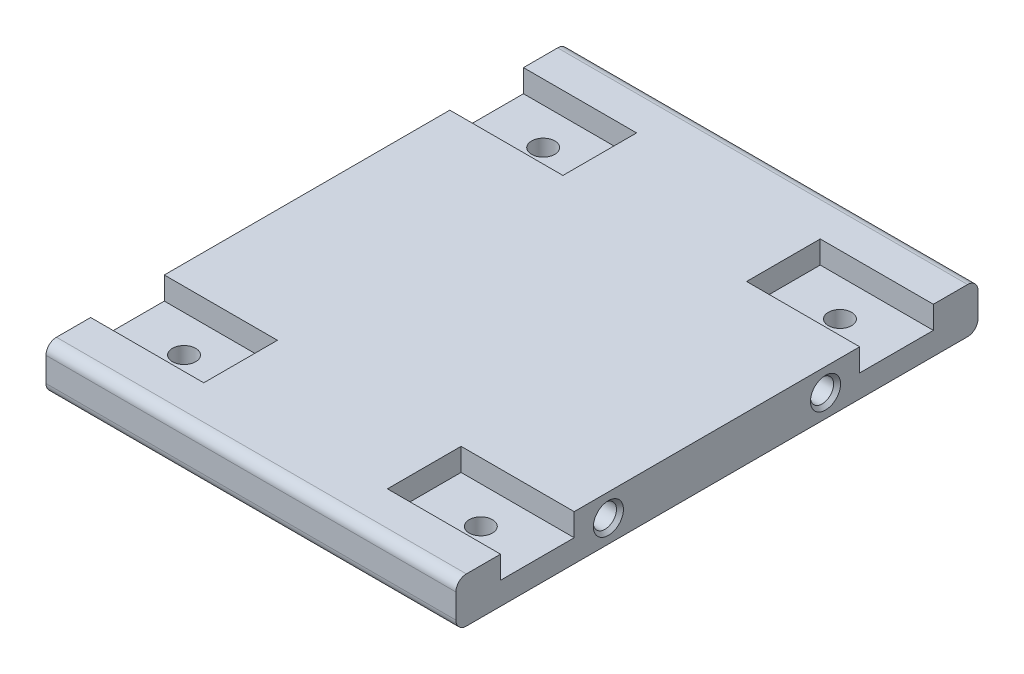
ISO-10303-21;
HEADER;
FILE_DESCRIPTION(('STEP AP214'),'2;1');
FILE_NAME('part.step','',(''),(''),'','','');
FILE_SCHEMA(('AUTOMOTIVE_DESIGN { 1 0 10303 214 1 1 1 1 }'));
ENDSEC;
DATA;
#1=APPLICATION_CONTEXT('core data for automotive mechanical design processes');
#2=APPLICATION_PROTOCOL_DEFINITION('international standard','automotive_design',2000,#1);
#3=PRODUCT_CONTEXT('',#1,'mechanical');
#4=PRODUCT('Part','Part','',(#3));
#5=PRODUCT_RELATED_PRODUCT_CATEGORY('part','',(#4));
#6=PRODUCT_DEFINITION_FORMATION('','',#4);
#7=PRODUCT_DEFINITION_CONTEXT('part definition',#1,'design');
#8=PRODUCT_DEFINITION('design','',#6,#7);
#9=PRODUCT_DEFINITION_SHAPE('','',#8);
#10=(LENGTH_UNIT() NAMED_UNIT(*) SI_UNIT(.MILLI.,.METRE.));
#11=(NAMED_UNIT(*) PLANE_ANGLE_UNIT() SI_UNIT($,.RADIAN.));
#12=(NAMED_UNIT(*) SI_UNIT($,.STERADIAN.) SOLID_ANGLE_UNIT());
#13=UNCERTAINTY_MEASURE_WITH_UNIT(LENGTH_MEASURE(1.E-05),#10,'distance_accuracy_value','');
#14=(GEOMETRIC_REPRESENTATION_CONTEXT(3) GLOBAL_UNCERTAINTY_ASSIGNED_CONTEXT((#13)) GLOBAL_UNIT_ASSIGNED_CONTEXT((#10,
#11,#12)) REPRESENTATION_CONTEXT('',''));
#15=CARTESIAN_POINT('',(0.,0.,0.));
#16=DIRECTION('',(0.,0.,1.));
#17=DIRECTION('',(1.,0.,0.));
#18=AXIS2_PLACEMENT_3D('',#15,#16,#17);
#19=CARTESIAN_POINT('',(0.,13.,0.));
#20=DIRECTION('',(0.,-1.,0.));
#21=DIRECTION('',(0.,0.,-1.));
#22=AXIS2_PLACEMENT_3D('',#19,#20,#21);
#23=PLANE('',#22);
#24=DIRECTION('',(1.,0.,0.));
#25=VECTOR('',#24,1.);
#26=CARTESIAN_POINT('',(26.38276945,13.,-41.012067555));
#27=LINE('',#26,#25);
#28=CARTESIAN_POINT('',(26.38276945,13.,-41.012067555));
#29=VERTEX_POINT('',#28);
#30=CARTESIAN_POINT('',(58.88276945,13.,-41.012067555));
#31=VERTEX_POINT('',#30);
#32=EDGE_CURVE('E244',#29,#31,#27,.T.);
#33=ORIENTED_EDGE('',*,*,#32,.F.);
#34=DIRECTION('',(0.,0.,-1.));
#35=VECTOR('',#34,1.);
#36=CARTESIAN_POINT('',(26.38276945,13.,0.));
#37=LINE('',#36,#35);
#38=CARTESIAN_POINT('',(26.38276945,13.,-62.176934205));
#39=VERTEX_POINT('',#38);
#40=EDGE_CURVE('E218',#29,#39,#37,.T.);
#41=ORIENTED_EDGE('',*,*,#40,.T.);
#42=DIRECTION('',(1.,0.,0.));
#43=VECTOR('',#42,1.);
#44=CARTESIAN_POINT('',(26.38276945,13.,-62.176934205));
#45=LINE('',#44,#43);
#46=CARTESIAN_POINT('',(58.88276945,13.,-62.176934205));
#47=VERTEX_POINT('',#46);
#48=EDGE_CURVE('E213',#39,#47,#45,.T.);
#49=ORIENTED_EDGE('',*,*,#48,.T.);
#50=DIRECTION('',(0.,0.,-1.));
#51=VECTOR('',#50,1.);
#52=CARTESIAN_POINT('',(58.88276945,13.,75.));
#53=LINE('',#52,#51);
#54=CARTESIAN_POINT('',(58.88276945,13.,-72.));
#55=VERTEX_POINT('',#54);
#56=EDGE_CURVE('E347',#47,#55,#53,.T.);
#57=ORIENTED_EDGE('',*,*,#56,.T.);
#58=DIRECTION('',(-1.,0.,0.));
#59=VECTOR('',#58,1.);
#60=CARTESIAN_POINT('',(0.,13.,-72.));
#61=LINE('',#60,#59);
#62=CARTESIAN_POINT('',(-58.88276945,13.,-72.));
#63=VERTEX_POINT('',#62);
#64=EDGE_CURVE('E399',#55,#63,#61,.T.);
#65=ORIENTED_EDGE('',*,*,#64,.T.);
#66=DIRECTION('',(0.,0.,1.));
#67=VECTOR('',#66,1.);
#68=CARTESIAN_POINT('',(-58.88276945,13.,75.));
#69=LINE('',#68,#67);
#70=CARTESIAN_POINT('',(-58.88276945,13.,-62.176934205));
#71=VERTEX_POINT('',#70);
#72=EDGE_CURVE('E348',#63,#71,#69,.T.);
#73=ORIENTED_EDGE('',*,*,#72,.T.);
#74=DIRECTION('',(-1.,0.,0.));
#75=VECTOR('',#74,1.);
#76=CARTESIAN_POINT('',(-26.38276945,13.,-62.176934205));
#77=LINE('',#76,#75);
#78=CARTESIAN_POINT('',(-26.38276945,13.,-62.176934205));
#79=VERTEX_POINT('',#78);
#80=EDGE_CURVE('E309',#79,#71,#77,.T.);
#81=ORIENTED_EDGE('',*,*,#80,.F.);
#82=DIRECTION('',(0.,0.,-1.));
#83=VECTOR('',#82,1.);
#84=CARTESIAN_POINT('',(-26.38276945,13.,0.));
#85=LINE('',#84,#83);
#86=CARTESIAN_POINT('',(-26.38276945,13.,-41.012067555));
#87=VERTEX_POINT('',#86);
#88=EDGE_CURVE('E292',#87,#79,#85,.T.);
#89=ORIENTED_EDGE('',*,*,#88,.F.);
#90=DIRECTION('',(-1.,0.,0.));
#91=VECTOR('',#90,1.);
#92=CARTESIAN_POINT('',(-26.38276945,13.,-41.012067555));
#93=LINE('',#92,#91);
#94=CARTESIAN_POINT('',(-58.88276945,13.,-41.012067555));
#95=VERTEX_POINT('',#94);
#96=EDGE_CURVE('E311',#87,#95,#93,.T.);
#97=ORIENTED_EDGE('',*,*,#96,.T.);
#98=CARTESIAN_POINT('',(-58.88276945,13.,41.012067555));
#99=VERTEX_POINT('',#98);
#100=EDGE_CURVE('E352',#95,#99,#69,.T.);
#101=ORIENTED_EDGE('',*,*,#100,.T.);
#102=DIRECTION('',(-1.,0.,0.));
#103=VECTOR('',#102,1.);
#104=CARTESIAN_POINT('',(-26.38276945,13.,41.012067555));
#105=LINE('',#104,#103);
#106=CARTESIAN_POINT('',(-26.38276945,13.,41.012067555));
#107=VERTEX_POINT('',#106);
#108=EDGE_CURVE('E338',#107,#99,#105,.T.);
#109=ORIENTED_EDGE('',*,*,#108,.F.);
#110=DIRECTION('',(0.,0.,-1.));
#111=VECTOR('',#110,1.);
#112=CARTESIAN_POINT('',(-26.38276945,13.,0.));
#113=LINE('',#112,#111);
#114=CARTESIAN_POINT('',(-26.38276945,13.,62.1769342050001));
#115=VERTEX_POINT('',#114);
#116=EDGE_CURVE('E318',#115,#107,#113,.T.);
#117=ORIENTED_EDGE('',*,*,#116,.F.);
#118=DIRECTION('',(-1.,0.,0.));
#119=VECTOR('',#118,1.);
#120=CARTESIAN_POINT('',(-26.38276945,13.,62.1769342050001));
#121=LINE('',#120,#119);
#122=CARTESIAN_POINT('',(-58.88276945,13.,62.1769342050001));
#123=VERTEX_POINT('',#122);
#124=EDGE_CURVE('E326',#115,#123,#121,.T.);
#125=ORIENTED_EDGE('',*,*,#124,.T.);
#126=CARTESIAN_POINT('',(-58.88276945,13.,72.));
#127=VERTEX_POINT('',#126);
#128=EDGE_CURVE('E345',#123,#127,#69,.T.);
#129=ORIENTED_EDGE('',*,*,#128,.T.);
#130=DIRECTION('',(1.,0.,0.));
#131=VECTOR('',#130,1.);
#132=CARTESIAN_POINT('',(0.,13.,72.));
#133=LINE('',#132,#131);
#134=CARTESIAN_POINT('',(58.88276945,13.,72.));
#135=VERTEX_POINT('',#134);
#136=EDGE_CURVE('E396',#127,#135,#133,.T.);
#137=ORIENTED_EDGE('',*,*,#136,.T.);
#138=CARTESIAN_POINT('',(58.88276945,13.,62.1769342050001));
#139=VERTEX_POINT('',#138);
#140=EDGE_CURVE('E342',#135,#139,#53,.T.);
#141=ORIENTED_EDGE('',*,*,#140,.T.);
#142=DIRECTION('',(1.,0.,0.));
#143=VECTOR('',#142,1.);
#144=CARTESIAN_POINT('',(26.38276945,13.,62.1769342050001));
#145=LINE('',#144,#143);
#146=CARTESIAN_POINT('',(26.38276945,13.,62.1769342050001));
#147=VERTEX_POINT('',#146);
#148=EDGE_CURVE('E239',#147,#139,#145,.T.);
#149=ORIENTED_EDGE('',*,*,#148,.F.);
#150=DIRECTION('',(0.,0.,-1.));
#151=VECTOR('',#150,1.);
#152=CARTESIAN_POINT('',(26.38276945,13.,0.));
#153=LINE('',#152,#151);
#154=CARTESIAN_POINT('',(26.38276945,13.,41.012067555));
#155=VERTEX_POINT('',#154);
#156=EDGE_CURVE('E257',#147,#155,#153,.T.);
#157=ORIENTED_EDGE('',*,*,#156,.T.);
#158=DIRECTION('',(1.,0.,0.));
#159=VECTOR('',#158,1.);
#160=CARTESIAN_POINT('',(26.38276945,13.,41.012067555));
#161=LINE('',#160,#159);
#162=CARTESIAN_POINT('',(58.88276945,13.,41.012067555));
#163=VERTEX_POINT('',#162);
#164=EDGE_CURVE('E268',#155,#163,#161,.T.);
#165=ORIENTED_EDGE('',*,*,#164,.T.);
#166=EDGE_CURVE('E346',#163,#31,#53,.T.);
#167=ORIENTED_EDGE('',*,*,#166,.T.);
#168=EDGE_LOOP('',(#33,#41,#49,#57,#65,#73,#81,#89,#97,#101,#109,#117,#125,#129,#137,#141,#149,
#157,#165,#167));
#169=FACE_BOUND('',#168,.T.);
#170=ADVANCED_FACE('F45',(#169),#23,.F.);
#171=CARTESIAN_POINT('',(58.88276945,13.,75.));
#172=DIRECTION('',(-1.,0.,0.));
#173=DIRECTION('',(0.,0.,1.));
#174=AXIS2_PLACEMENT_3D('',#171,#172,#173);
#175=PLANE('',#174);
#176=CARTESIAN_POINT('',(58.88276945,6.5,31.1890017600001));
#177=DIRECTION('',(-1.,0.,0.));
#178=DIRECTION('',(0.,0.,1.));
#179=AXIS2_PLACEMENT_3D('',#176,#177,#178);
#180=CIRCLE('',#179,4.32500000000002);
#181=CARTESIAN_POINT('',(58.88276945,6.5,35.5140017600001));
#182=VERTEX_POINT('',#181);
#183=EDGE_CURVE('E416',#182,#182,#180,.T.);
#184=ORIENTED_EDGE('',*,*,#183,.T.);
#185=EDGE_LOOP('',(#184));
#186=FACE_BOUND('',#185,.T.);
#187=CARTESIAN_POINT('',(58.88276945,6.5,-31.18900176));
#188=DIRECTION('',(-1.,0.,0.));
#189=DIRECTION('',(0.,0.,1.));
#190=AXIS2_PLACEMENT_3D('',#187,#188,#189);
#191=CIRCLE('',#190,4.32500000000002);
#192=CARTESIAN_POINT('',(58.88276945,6.5,-26.86400176));
#193=VERTEX_POINT('',#192);
#194=EDGE_CURVE('E413',#193,#193,#191,.T.);
#195=ORIENTED_EDGE('',*,*,#194,.T.);
#196=EDGE_LOOP('',(#195));
#197=FACE_BOUND('',#196,.T.);
#198=DIRECTION('',(0.,1.,0.));
#199=VECTOR('',#198,1.);
#200=CARTESIAN_POINT('',(58.88276945,0.,-41.012067555));
#201=LINE('',#200,#199);
#202=CARTESIAN_POINT('',(58.88276945,6.50000000000001,-41.012067555));
#203=VERTEX_POINT('',#202);
#204=EDGE_CURVE('E227',#203,#31,#201,.T.);
#205=ORIENTED_EDGE('',*,*,#204,.T.);
#206=ORIENTED_EDGE('',*,*,#166,.F.);
#207=DIRECTION('',(0.,1.,0.));
#208=VECTOR('',#207,1.);
#209=CARTESIAN_POINT('',(58.88276945,0.,41.012067555));
#210=LINE('',#209,#208);
#211=CARTESIAN_POINT('',(58.88276945,6.5,41.012067555));
#212=VERTEX_POINT('',#211);
#213=EDGE_CURVE('E251',#212,#163,#210,.T.);
#214=ORIENTED_EDGE('',*,*,#213,.F.);
#215=DIRECTION('',(0.,0.,-1.));
#216=VECTOR('',#215,1.);
#217=CARTESIAN_POINT('',(58.88276945,6.50000000000002,0.));
#218=LINE('',#217,#216);
#219=CARTESIAN_POINT('',(58.88276945,6.5,62.1769342050001));
#220=VERTEX_POINT('',#219);
#221=EDGE_CURVE('E262',#220,#212,#218,.T.);
#222=ORIENTED_EDGE('',*,*,#221,.F.);
#223=DIRECTION('',(0.,-1.,0.));
#224=VECTOR('',#223,1.);
#225=CARTESIAN_POINT('',(58.88276945,0.,62.1769342050001));
#226=LINE('',#225,#224);
#227=EDGE_CURVE('E69',#139,#220,#226,.T.);
#228=ORIENTED_EDGE('',*,*,#227,.F.);
#229=ORIENTED_EDGE('',*,*,#140,.F.);
#230=CARTESIAN_POINT('',(58.88276945,10.,72.));
#231=DIRECTION('',(-1.,0.,0.));
#232=DIRECTION('',(0.,0.,1.));
#233=AXIS2_PLACEMENT_3D('',#230,#231,#232);
#234=CIRCLE('',#233,3.);
#235=CARTESIAN_POINT('',(58.88276945,10.,75.));
#236=VERTEX_POINT('',#235);
#237=EDGE_CURVE('E387',#135,#236,#234,.F.);
#238=ORIENTED_EDGE('',*,*,#237,.T.);
#239=DIRECTION('',(0.,-1.,0.));
#240=VECTOR('',#239,1.);
#241=CARTESIAN_POINT('',(58.88276945,13.,75.));
#242=LINE('',#241,#240);
#243=CARTESIAN_POINT('',(58.88276945,3.,75.));
#244=VERTEX_POINT('',#243);
#245=EDGE_CURVE('E351',#236,#244,#242,.T.);
#246=ORIENTED_EDGE('',*,*,#245,.T.);
#247=CARTESIAN_POINT('',(58.88276945,3.,72.));
#248=DIRECTION('',(-1.,0.,0.));
#249=DIRECTION('',(0.,0.,1.));
#250=AXIS2_PLACEMENT_3D('',#247,#248,#249);
#251=CIRCLE('',#250,3.);
#252=CARTESIAN_POINT('',(58.88276945,0.,72.));
#253=VERTEX_POINT('',#252);
#254=EDGE_CURVE('E389',#244,#253,#251,.F.);
#255=ORIENTED_EDGE('',*,*,#254,.T.);
#256=DIRECTION('',(0.,0.,-1.));
#257=VECTOR('',#256,1.);
#258=CARTESIAN_POINT('',(58.88276945,0.,75.));
#259=LINE('',#258,#257);
#260=CARTESIAN_POINT('',(58.88276945,0.,-72.));
#261=VERTEX_POINT('',#260);
#262=EDGE_CURVE('E308',#253,#261,#259,.T.);
#263=ORIENTED_EDGE('',*,*,#262,.T.);
#264=CARTESIAN_POINT('',(58.88276945,3.,-72.));
#265=DIRECTION('',(-1.,0.,0.));
#266=DIRECTION('',(0.,0.,1.));
#267=AXIS2_PLACEMENT_3D('',#264,#265,#266);
#268=CIRCLE('',#267,3.);
#269=CARTESIAN_POINT('',(58.88276945,3.,-75.));
#270=VERTEX_POINT('',#269);
#271=EDGE_CURVE('E394',#261,#270,#268,.F.);
#272=ORIENTED_EDGE('',*,*,#271,.T.);
#273=DIRECTION('',(0.,-1.,0.));
#274=VECTOR('',#273,1.);
#275=CARTESIAN_POINT('',(58.88276945,13.,-75.));
#276=LINE('',#275,#274);
#277=CARTESIAN_POINT('',(58.88276945,10.,-75.));
#278=VERTEX_POINT('',#277);
#279=EDGE_CURVE('E366',#278,#270,#276,.T.);
#280=ORIENTED_EDGE('',*,*,#279,.F.);
#281=CARTESIAN_POINT('',(58.88276945,10.,-72.));
#282=DIRECTION('',(-1.,0.,0.));
#283=DIRECTION('',(0.,0.,1.));
#284=AXIS2_PLACEMENT_3D('',#281,#282,#283);
#285=CIRCLE('',#284,3.);
#286=EDGE_CURVE('E391',#278,#55,#285,.F.);
#287=ORIENTED_EDGE('',*,*,#286,.T.);
#288=ORIENTED_EDGE('',*,*,#56,.F.);
#289=DIRECTION('',(0.,-1.,0.));
#290=VECTOR('',#289,1.);
#291=CARTESIAN_POINT('',(58.88276945,0.,-62.176934205));
#292=LINE('',#291,#290);
#293=CARTESIAN_POINT('',(58.88276945,6.5,-62.176934205));
#294=VERTEX_POINT('',#293);
#295=EDGE_CURVE('E230',#47,#294,#292,.T.);
#296=ORIENTED_EDGE('',*,*,#295,.T.);
#297=DIRECTION('',(0.,0.,1.));
#298=VECTOR('',#297,1.);
#299=CARTESIAN_POINT('',(58.88276945,6.50000000000002,0.));
#300=LINE('',#299,#298);
#301=EDGE_CURVE('E61',#294,#203,#300,.T.);
#302=ORIENTED_EDGE('',*,*,#301,.T.);
#303=EDGE_LOOP('',(#205,#206,#214,#222,#228,#229,#238,#246,#255,#263,#272,#280,#287,#288,#296,#302));
#304=FACE_BOUND('',#303,.T.);
#305=ADVANCED_FACE('F454',(#186,#197,#304),#175,.F.);
#306=CARTESIAN_POINT('',(-58.88276945,13.,75.));
#307=DIRECTION('',(1.,0.,0.));
#308=DIRECTION('',(0.,0.,-1.));
#309=AXIS2_PLACEMENT_3D('',#306,#307,#308);
#310=PLANE('',#309);
#311=CARTESIAN_POINT('',(-58.88276945,6.5,31.1890017600001));
#312=DIRECTION('',(1.,0.,0.));
#313=DIRECTION('',(0.,0.,-1.));
#314=AXIS2_PLACEMENT_3D('',#311,#312,#313);
#315=CIRCLE('',#314,4.325);
#316=CARTESIAN_POINT('',(-58.88276945,6.5,26.8640017600001));
#317=VERTEX_POINT('',#316);
#318=EDGE_CURVE('E11',#317,#317,#315,.T.);
#319=ORIENTED_EDGE('',*,*,#318,.T.);
#320=EDGE_LOOP('',(#319));
#321=FACE_BOUND('',#320,.T.);
#322=CARTESIAN_POINT('',(-58.88276945,6.5,-31.18900176));
#323=DIRECTION('',(1.,0.,0.));
#324=DIRECTION('',(0.,0.,-1.));
#325=AXIS2_PLACEMENT_3D('',#322,#323,#324);
#326=CIRCLE('',#325,4.325);
#327=CARTESIAN_POINT('',(-58.88276945,6.5,-35.51400176));
#328=VERTEX_POINT('',#327);
#329=EDGE_CURVE('E54',#328,#328,#326,.T.);
#330=ORIENTED_EDGE('',*,*,#329,.T.);
#331=EDGE_LOOP('',(#330));
#332=FACE_BOUND('',#331,.T.);
#333=DIRECTION('',(0.,0.,1.));
#334=VECTOR('',#333,1.);
#335=CARTESIAN_POINT('',(-58.88276945,6.50000000000002,0.));
#336=LINE('',#335,#334);
#337=CARTESIAN_POINT('',(-58.88276945,6.5,-62.176934205));
#338=VERTEX_POINT('',#337);
#339=CARTESIAN_POINT('',(-58.88276945,6.50000000000001,-41.012067555));
#340=VERTEX_POINT('',#339);
#341=EDGE_CURVE('E298',#338,#340,#336,.T.);
#342=ORIENTED_EDGE('',*,*,#341,.F.);
#343=DIRECTION('',(0.,-1.,0.));
#344=VECTOR('',#343,1.);
#345=CARTESIAN_POINT('',(-58.88276945,0.,-62.176934205));
#346=LINE('',#345,#344);
#347=EDGE_CURVE('E290',#71,#338,#346,.T.);
#348=ORIENTED_EDGE('',*,*,#347,.F.);
#349=ORIENTED_EDGE('',*,*,#72,.F.);
#350=CARTESIAN_POINT('',(-58.88276945,10.,-72.));
#351=DIRECTION('',(1.,0.,0.));
#352=DIRECTION('',(0.,0.,-1.));
#353=AXIS2_PLACEMENT_3D('',#350,#351,#352);
#354=CIRCLE('',#353,3.);
#355=CARTESIAN_POINT('',(-58.88276945,10.,-75.));
#356=VERTEX_POINT('',#355);
#357=EDGE_CURVE('E379',#63,#356,#354,.F.);
#358=ORIENTED_EDGE('',*,*,#357,.T.);
#359=DIRECTION('',(0.,-1.,0.));
#360=VECTOR('',#359,1.);
#361=CARTESIAN_POINT('',(-58.88276945,13.,-75.));
#362=LINE('',#361,#360);
#363=CARTESIAN_POINT('',(-58.88276945,3.,-75.));
#364=VERTEX_POINT('',#363);
#365=EDGE_CURVE('E363',#356,#364,#362,.T.);
#366=ORIENTED_EDGE('',*,*,#365,.T.);
#367=CARTESIAN_POINT('',(-58.88276945,3.,-72.));
#368=DIRECTION('',(1.,0.,0.));
#369=DIRECTION('',(0.,0.,-1.));
#370=AXIS2_PLACEMENT_3D('',#367,#368,#369);
#371=CIRCLE('',#370,3.);
#372=CARTESIAN_POINT('',(-58.88276945,0.,-72.));
#373=VERTEX_POINT('',#372);
#374=EDGE_CURVE('E381',#364,#373,#371,.F.);
#375=ORIENTED_EDGE('',*,*,#374,.T.);
#376=DIRECTION('',(0.,0.,1.));
#377=VECTOR('',#376,1.);
#378=CARTESIAN_POINT('',(-58.88276945,0.,75.));
#379=LINE('',#378,#377);
#380=CARTESIAN_POINT('',(-58.88276945,0.,72.));
#381=VERTEX_POINT('',#380);
#382=EDGE_CURVE('E355',#373,#381,#379,.T.);
#383=ORIENTED_EDGE('',*,*,#382,.T.);
#384=CARTESIAN_POINT('',(-58.88276945,3.,72.));
#385=DIRECTION('',(1.,0.,0.));
#386=DIRECTION('',(0.,0.,-1.));
#387=AXIS2_PLACEMENT_3D('',#384,#385,#386);
#388=CIRCLE('',#387,3.);
#389=CARTESIAN_POINT('',(-58.88276945,3.,75.));
#390=VERTEX_POINT('',#389);
#391=EDGE_CURVE('E377',#381,#390,#388,.F.);
#392=ORIENTED_EDGE('',*,*,#391,.T.);
#393=DIRECTION('',(0.,-1.,0.));
#394=VECTOR('',#393,1.);
#395=CARTESIAN_POINT('',(-58.88276945,13.,75.));
#396=LINE('',#395,#394);
#397=CARTESIAN_POINT('',(-58.88276945,10.,75.));
#398=VERTEX_POINT('',#397);
#399=EDGE_CURVE('E360',#398,#390,#396,.T.);
#400=ORIENTED_EDGE('',*,*,#399,.F.);
#401=CARTESIAN_POINT('',(-58.88276945,10.,72.));
#402=DIRECTION('',(1.,0.,0.));
#403=DIRECTION('',(0.,0.,-1.));
#404=AXIS2_PLACEMENT_3D('',#401,#402,#403);
#405=CIRCLE('',#404,3.);
#406=EDGE_CURVE('E374',#398,#127,#405,.F.);
#407=ORIENTED_EDGE('',*,*,#406,.T.);
#408=ORIENTED_EDGE('',*,*,#128,.F.);
#409=DIRECTION('',(0.,-1.,0.));
#410=VECTOR('',#409,1.);
#411=CARTESIAN_POINT('',(-58.88276945,0.,62.1769342050001));
#412=LINE('',#411,#410);
#413=CARTESIAN_POINT('',(-58.88276945,6.5,62.1769342050001));
#414=VERTEX_POINT('',#413);
#415=EDGE_CURVE('E281',#123,#414,#412,.T.);
#416=ORIENTED_EDGE('',*,*,#415,.T.);
#417=DIRECTION('',(0.,0.,-1.));
#418=VECTOR('',#417,1.);
#419=CARTESIAN_POINT('',(-58.88276945,6.50000000000002,0.));
#420=LINE('',#419,#418);
#421=CARTESIAN_POINT('',(-58.88276945,6.5,41.012067555));
#422=VERTEX_POINT('',#421);
#423=EDGE_CURVE('E319',#414,#422,#420,.T.);
#424=ORIENTED_EDGE('',*,*,#423,.T.);
#425=DIRECTION('',(0.,1.,0.));
#426=VECTOR('',#425,1.);
#427=CARTESIAN_POINT('',(-58.88276945,0.,41.012067555));
#428=LINE('',#427,#426);
#429=EDGE_CURVE('E329',#422,#99,#428,.T.);
#430=ORIENTED_EDGE('',*,*,#429,.T.);
#431=ORIENTED_EDGE('',*,*,#100,.F.);
#432=DIRECTION('',(0.,1.,0.));
#433=VECTOR('',#432,1.);
#434=CARTESIAN_POINT('',(-58.88276945,0.,-41.012067555));
#435=LINE('',#434,#433);
#436=EDGE_CURVE('E301',#340,#95,#435,.T.);
#437=ORIENTED_EDGE('',*,*,#436,.F.);
#438=EDGE_LOOP('',(#342,#348,#349,#358,#366,#375,#383,#392,#400,#407,#408,#416,#424,#430,#431,#437));
#439=FACE_BOUND('',#438,.T.);
#440=ADVANCED_FACE('F427',(#321,#332,#439),#310,.F.);
#441=CARTESIAN_POINT('',(-58.88276945,13.,-75.));
#442=DIRECTION('',(0.,0.,1.));
#443=DIRECTION('',(1.,0.,0.));
#444=AXIS2_PLACEMENT_3D('',#441,#442,#443);
#445=PLANE('',#444);
#446=ORIENTED_EDGE('',*,*,#279,.T.);
#447=DIRECTION('',(-1.,0.,0.));
#448=VECTOR('',#447,1.);
#449=CARTESIAN_POINT('',(-58.88276945,3.,-75.));
#450=LINE('',#449,#448);
#451=EDGE_CURVE('E371',#270,#364,#450,.T.);
#452=ORIENTED_EDGE('',*,*,#451,.T.);
#453=ORIENTED_EDGE('',*,*,#365,.F.);
#454=DIRECTION('',(-1.,0.,0.));
#455=VECTOR('',#454,1.);
#456=CARTESIAN_POINT('',(-58.88276945,10.,-75.));
#457=LINE('',#456,#455);
#458=EDGE_CURVE('E369',#356,#278,#457,.F.);
#459=ORIENTED_EDGE('',*,*,#458,.T.);
#460=EDGE_LOOP('',(#446,#452,#453,#459));
#461=FACE_BOUND('',#460,.T.);
#462=ADVANCED_FACE('F476',(#461),#445,.F.);
#463=CARTESIAN_POINT('',(-58.88276945,13.,75.));
#464=DIRECTION('',(0.,0.,-1.));
#465=DIRECTION('',(-1.,0.,0.));
#466=AXIS2_PLACEMENT_3D('',#463,#464,#465);
#467=PLANE('',#466);
#468=ORIENTED_EDGE('',*,*,#399,.T.);
#469=DIRECTION('',(1.,0.,0.));
#470=VECTOR('',#469,1.);
#471=CARTESIAN_POINT('',(58.88276945,3.,75.));
#472=LINE('',#471,#470);
#473=EDGE_CURVE('E404',#390,#244,#472,.T.);
#474=ORIENTED_EDGE('',*,*,#473,.T.);
#475=ORIENTED_EDGE('',*,*,#245,.F.);
#476=DIRECTION('',(1.,0.,0.));
#477=VECTOR('',#476,1.);
#478=CARTESIAN_POINT('',(-58.88276945,10.,75.));
#479=LINE('',#478,#477);
#480=EDGE_CURVE('E402',#236,#398,#479,.F.);
#481=ORIENTED_EDGE('',*,*,#480,.T.);
#482=EDGE_LOOP('',(#468,#474,#475,#481));
#483=FACE_BOUND('',#482,.T.);
#484=ADVANCED_FACE('F472',(#483),#467,.F.);
#485=CARTESIAN_POINT('',(0.,0.,0.));
#486=DIRECTION('',(0.,-1.,0.));
#487=DIRECTION('',(0.,0.,-1.));
#488=AXIS2_PLACEMENT_3D('',#485,#486,#487);
#489=PLANE('',#488);
#490=CARTESIAN_POINT('',(42.63276945,0.,-51.59450088));
#491=DIRECTION('',(0.,-1.,0.));
#492=DIRECTION('',(0.,0.,-1.));
#493=AXIS2_PLACEMENT_3D('',#490,#491,#492);
#494=CIRCLE('',#493,3.35);
#495=CARTESIAN_POINT('',(42.63276945,0.,-54.94450088));
#496=VERTEX_POINT('',#495);
#497=EDGE_CURVE('E263',#496,#496,#494,.T.);
#498=ORIENTED_EDGE('',*,*,#497,.F.);
#499=EDGE_LOOP('',(#498));
#500=FACE_BOUND('',#499,.T.);
#501=CARTESIAN_POINT('',(42.63276945,0.,51.59450088));
#502=DIRECTION('',(0.,-1.,0.));
#503=DIRECTION('',(0.,0.,-1.));
#504=AXIS2_PLACEMENT_3D('',#501,#502,#503);
#505=CIRCLE('',#504,3.35);
#506=CARTESIAN_POINT('',(42.63276945,0.,48.24450088));
#507=VERTEX_POINT('',#506);
#508=EDGE_CURVE('E233',#507,#507,#505,.T.);
#509=ORIENTED_EDGE('',*,*,#508,.F.);
#510=EDGE_LOOP('',(#509));
#511=FACE_BOUND('',#510,.T.);
#512=CARTESIAN_POINT('',(-42.63276945,0.,-51.59450088));
#513=DIRECTION('',(0.,-1.,0.));
#514=DIRECTION('',(0.,0.,-1.));
#515=AXIS2_PLACEMENT_3D('',#512,#513,#514);
#516=CIRCLE('',#515,3.35);
#517=CARTESIAN_POINT('',(-42.63276945,0.,-54.94450088));
#518=VERTEX_POINT('',#517);
#519=EDGE_CURVE('E277',#518,#518,#516,.F.);
#520=ORIENTED_EDGE('',*,*,#519,.T.);
#521=EDGE_LOOP('',(#520));
#522=FACE_BOUND('',#521,.T.);
#523=CARTESIAN_POINT('',(-42.63276945,0.,51.59450088));
#524=DIRECTION('',(0.,-1.,0.));
#525=DIRECTION('',(0.,0.,-1.));
#526=AXIS2_PLACEMENT_3D('',#523,#524,#525);
#527=CIRCLE('',#526,3.35);
#528=CARTESIAN_POINT('',(-42.63276945,0.,48.24450088));
#529=VERTEX_POINT('',#528);
#530=EDGE_CURVE('E243',#529,#529,#527,.F.);
#531=ORIENTED_EDGE('',*,*,#530,.T.);
#532=EDGE_LOOP('',(#531));
#533=FACE_BOUND('',#532,.T.);
#534=ORIENTED_EDGE('',*,*,#382,.F.);
#535=DIRECTION('',(-1.,0.,0.));
#536=VECTOR('',#535,1.);
#537=CARTESIAN_POINT('',(58.88276945,0.,-72.));
#538=LINE('',#537,#536);
#539=EDGE_CURVE('E385',#373,#261,#538,.F.);
#540=ORIENTED_EDGE('',*,*,#539,.T.);
#541=ORIENTED_EDGE('',*,*,#262,.F.);
#542=DIRECTION('',(1.,0.,0.));
#543=VECTOR('',#542,1.);
#544=CARTESIAN_POINT('',(-58.88276945,0.,72.));
#545=LINE('',#544,#543);
#546=EDGE_CURVE('E383',#253,#381,#545,.F.);
#547=ORIENTED_EDGE('',*,*,#546,.T.);
#548=EDGE_LOOP('',(#534,#540,#541,#547));
#549=FACE_BOUND('',#548,.T.);
#550=ADVANCED_FACE('F469',(#500,#511,#522,#533,#549),#489,.T.);
#551=CARTESIAN_POINT('',(-58.88276945,3.,-72.));
#552=DIRECTION('',(1.,0.,0.));
#553=DIRECTION('',(0.,0.,-1.));
#554=AXIS2_PLACEMENT_3D('',#551,#552,#553);
#555=CYLINDRICAL_SURFACE('',#554,3.);
#556=ORIENTED_EDGE('',*,*,#271,.F.);
#557=ORIENTED_EDGE('',*,*,#539,.F.);
#558=ORIENTED_EDGE('',*,*,#374,.F.);
#559=ORIENTED_EDGE('',*,*,#451,.F.);
#560=EDGE_LOOP('',(#556,#557,#558,#559));
#561=FACE_BOUND('',#560,.T.);
#562=ADVANCED_FACE('F471',(#561),#555,.T.);
#563=CARTESIAN_POINT('',(0.,10.,-72.));
#564=DIRECTION('',(-1.,0.,0.));
#565=DIRECTION('',(0.,0.,1.));
#566=AXIS2_PLACEMENT_3D('',#563,#564,#565);
#567=CYLINDRICAL_SURFACE('',#566,3.);
#568=ORIENTED_EDGE('',*,*,#286,.F.);
#569=ORIENTED_EDGE('',*,*,#458,.F.);
#570=ORIENTED_EDGE('',*,*,#357,.F.);
#571=ORIENTED_EDGE('',*,*,#64,.F.);
#572=EDGE_LOOP('',(#568,#569,#570,#571));
#573=FACE_BOUND('',#572,.T.);
#574=ADVANCED_FACE('F485',(#573),#567,.T.);
#575=CARTESIAN_POINT('',(-58.88276945,3.,72.));
#576=DIRECTION('',(-1.,0.,0.));
#577=DIRECTION('',(0.,0.,1.));
#578=AXIS2_PLACEMENT_3D('',#575,#576,#577);
#579=CYLINDRICAL_SURFACE('',#578,3.);
#580=ORIENTED_EDGE('',*,*,#391,.F.);
#581=ORIENTED_EDGE('',*,*,#546,.F.);
#582=ORIENTED_EDGE('',*,*,#254,.F.);
#583=ORIENTED_EDGE('',*,*,#473,.F.);
#584=EDGE_LOOP('',(#580,#581,#582,#583));
#585=FACE_BOUND('',#584,.T.);
#586=ADVANCED_FACE('F489',(#585),#579,.T.);
#587=CARTESIAN_POINT('',(0.,10.,72.));
#588=DIRECTION('',(1.,0.,0.));
#589=DIRECTION('',(0.,0.,-1.));
#590=AXIS2_PLACEMENT_3D('',#587,#588,#589);
#591=CYLINDRICAL_SURFACE('',#590,3.);
#592=ORIENTED_EDGE('',*,*,#406,.F.);
#593=ORIENTED_EDGE('',*,*,#480,.F.);
#594=ORIENTED_EDGE('',*,*,#237,.F.);
#595=ORIENTED_EDGE('',*,*,#136,.F.);
#596=EDGE_LOOP('',(#592,#593,#594,#595));
#597=FACE_BOUND('',#596,.T.);
#598=ADVANCED_FACE('F493',(#597),#591,.T.);
#599=CARTESIAN_POINT('',(-26.38276945,0.,62.1769342050001));
#600=DIRECTION('',(0.,0.,-1.));
#601=DIRECTION('',(-1.,0.,0.));
#602=AXIS2_PLACEMENT_3D('',#599,#600,#601);
#603=PLANE('',#602);
#604=ORIENTED_EDGE('',*,*,#415,.F.);
#605=ORIENTED_EDGE('',*,*,#124,.F.);
#606=DIRECTION('',(0.,-1.,0.));
#607=VECTOR('',#606,1.);
#608=CARTESIAN_POINT('',(-26.38276945,0.,62.1769342050001));
#609=LINE('',#608,#607);
#610=CARTESIAN_POINT('',(-26.38276945,6.5,62.1769342050001));
#611=VERTEX_POINT('',#610);
#612=EDGE_CURVE('E315',#115,#611,#609,.T.);
#613=ORIENTED_EDGE('',*,*,#612,.T.);
#614=DIRECTION('',(-1.,0.,0.));
#615=VECTOR('',#614,1.);
#616=CARTESIAN_POINT('',(-26.38276945,6.5,62.1769342050001));
#617=LINE('',#616,#615);
#618=EDGE_CURVE('E302',#611,#414,#617,.T.);
#619=ORIENTED_EDGE('',*,*,#618,.T.);
#620=EDGE_LOOP('',(#604,#605,#613,#619));
#621=FACE_BOUND('',#620,.T.);
#622=ADVANCED_FACE('F467',(#621),#603,.T.);
#623=CARTESIAN_POINT('',(-26.38276945,6.50000000000002,0.));
#624=DIRECTION('',(0.,1.,0.));
#625=DIRECTION('',(0.,0.,1.));
#626=AXIS2_PLACEMENT_3D('',#623,#624,#625);
#627=PLANE('',#626);
#628=CARTESIAN_POINT('',(-42.63276945,6.50000000000003,51.59450088));
#629=DIRECTION('',(0.,1.,0.));
#630=DIRECTION('',(0.,0.,-1.));
#631=AXIS2_PLACEMENT_3D('',#628,#629,#630);
#632=CIRCLE('',#631,3.35);
#633=CARTESIAN_POINT('',(-42.63276945,6.50000000000003,48.24450088));
#634=VERTEX_POINT('',#633);
#635=EDGE_CURVE('E278',#634,#634,#632,.T.);
#636=ORIENTED_EDGE('',*,*,#635,.F.);
#637=EDGE_LOOP('',(#636));
#638=FACE_BOUND('',#637,.T.);
#639=ORIENTED_EDGE('',*,*,#423,.F.);
#640=ORIENTED_EDGE('',*,*,#618,.F.);
#641=DIRECTION('',(0.,0.,-1.));
#642=VECTOR('',#641,1.);
#643=CARTESIAN_POINT('',(-26.38276945,6.50000000000002,0.));
#644=LINE('',#643,#642);
#645=CARTESIAN_POINT('',(-26.38276945,6.5,41.012067555));
#646=VERTEX_POINT('',#645);
#647=EDGE_CURVE('E324',#611,#646,#644,.T.);
#648=ORIENTED_EDGE('',*,*,#647,.T.);
#649=DIRECTION('',(-1.,0.,0.));
#650=VECTOR('',#649,1.);
#651=CARTESIAN_POINT('',(-26.38276945,6.5,41.012067555));
#652=LINE('',#651,#650);
#653=EDGE_CURVE('E336',#646,#422,#652,.T.);
#654=ORIENTED_EDGE('',*,*,#653,.T.);
#655=EDGE_LOOP('',(#639,#640,#648,#654));
#656=FACE_BOUND('',#655,.T.);
#657=ADVANCED_FACE('F707',(#638,#656),#627,.T.);
#658=CARTESIAN_POINT('',(-26.38276945,0.,41.012067555));
#659=DIRECTION('',(0.,0.,1.));
#660=DIRECTION('',(0.,-1.,0.));
#661=AXIS2_PLACEMENT_3D('',#658,#659,#660);
#662=PLANE('',#661);
#663=ORIENTED_EDGE('',*,*,#429,.F.);
#664=ORIENTED_EDGE('',*,*,#653,.F.);
#665=DIRECTION('',(0.,1.,0.));
#666=VECTOR('',#665,1.);
#667=CARTESIAN_POINT('',(-26.38276945,0.,41.012067555));
#668=LINE('',#667,#666);
#669=EDGE_CURVE('E322',#646,#107,#668,.T.);
#670=ORIENTED_EDGE('',*,*,#669,.T.);
#671=ORIENTED_EDGE('',*,*,#108,.T.);
#672=EDGE_LOOP('',(#663,#664,#670,#671));
#673=FACE_BOUND('',#672,.T.);
#674=ADVANCED_FACE('F698',(#673),#662,.T.);
#675=CARTESIAN_POINT('',(-26.38276945,0.,0.));
#676=DIRECTION('',(-1.,0.,0.));
#677=DIRECTION('',(0.,0.,1.));
#678=AXIS2_PLACEMENT_3D('',#675,#676,#677);
#679=PLANE('',#678);
#680=ORIENTED_EDGE('',*,*,#612,.F.);
#681=ORIENTED_EDGE('',*,*,#116,.T.);
#682=ORIENTED_EDGE('',*,*,#669,.F.);
#683=ORIENTED_EDGE('',*,*,#647,.F.);
#684=EDGE_LOOP('',(#680,#681,#682,#683));
#685=FACE_BOUND('',#684,.T.);
#686=ADVANCED_FACE('F689',(#685),#679,.T.);
#687=CARTESIAN_POINT('',(-26.38276945,6.50000000000002,0.));
#688=DIRECTION('',(0.,-1.,0.));
#689=DIRECTION('',(0.,0.,-1.));
#690=AXIS2_PLACEMENT_3D('',#687,#688,#689);
#691=PLANE('',#690);
#692=CARTESIAN_POINT('',(-42.63276945,6.50000000000001,-51.59450088));
#693=DIRECTION('',(0.,1.,0.));
#694=DIRECTION('',(0.,0.,1.));
#695=AXIS2_PLACEMENT_3D('',#692,#693,#694);
#696=CIRCLE('',#695,3.35);
#697=CARTESIAN_POINT('',(-42.63276945,6.50000000000001,-48.24450088));
#698=VERTEX_POINT('',#697);
#699=EDGE_CURVE('E274',#698,#698,#696,.T.);
#700=ORIENTED_EDGE('',*,*,#699,.F.);
#701=EDGE_LOOP('',(#700));
#702=FACE_BOUND('',#701,.T.);
#703=ORIENTED_EDGE('',*,*,#341,.T.);
#704=DIRECTION('',(-1.,0.,0.));
#705=VECTOR('',#704,1.);
#706=CARTESIAN_POINT('',(-26.38276945,6.50000000000001,-41.012067555));
#707=LINE('',#706,#705);
#708=CARTESIAN_POINT('',(-26.38276945,6.50000000000001,-41.012067555));
#709=VERTEX_POINT('',#708);
#710=EDGE_CURVE('E297',#709,#340,#707,.T.);
#711=ORIENTED_EDGE('',*,*,#710,.F.);
#712=DIRECTION('',(0.,0.,1.));
#713=VECTOR('',#712,1.);
#714=CARTESIAN_POINT('',(-26.38276945,6.50000000000002,0.));
#715=LINE('',#714,#713);
#716=CARTESIAN_POINT('',(-26.38276945,6.5,-62.176934205));
#717=VERTEX_POINT('',#716);
#718=EDGE_CURVE('E286',#717,#709,#715,.T.);
#719=ORIENTED_EDGE('',*,*,#718,.F.);
#720=DIRECTION('',(-1.,0.,0.));
#721=VECTOR('',#720,1.);
#722=CARTESIAN_POINT('',(-26.38276945,6.5,-62.176934205));
#723=LINE('',#722,#721);
#724=EDGE_CURVE('E306',#717,#338,#723,.T.);
#725=ORIENTED_EDGE('',*,*,#724,.T.);
#726=EDGE_LOOP('',(#703,#711,#719,#725));
#727=FACE_BOUND('',#726,.T.);
#728=ADVANCED_FACE('F680',(#702,#727),#691,.F.);
#729=CARTESIAN_POINT('',(-26.38276945,0.,-62.176934205));
#730=DIRECTION('',(0.,0.,-1.));
#731=DIRECTION('',(-1.,0.,0.));
#732=AXIS2_PLACEMENT_3D('',#729,#730,#731);
#733=PLANE('',#732);
#734=ORIENTED_EDGE('',*,*,#347,.T.);
#735=ORIENTED_EDGE('',*,*,#724,.F.);
#736=DIRECTION('',(0.,-1.,0.));
#737=VECTOR('',#736,1.);
#738=CARTESIAN_POINT('',(-26.38276945,0.,-62.176934205));
#739=LINE('',#738,#737);
#740=EDGE_CURVE('E294',#79,#717,#739,.T.);
#741=ORIENTED_EDGE('',*,*,#740,.F.);
#742=ORIENTED_EDGE('',*,*,#80,.T.);
#743=EDGE_LOOP('',(#734,#735,#741,#742));
#744=FACE_BOUND('',#743,.T.);
#745=ADVANCED_FACE('F671',(#744),#733,.F.);
#746=CARTESIAN_POINT('',(-26.38276945,0.,-41.012067555));
#747=DIRECTION('',(0.,0.,1.));
#748=DIRECTION('',(0.,-1.,0.));
#749=AXIS2_PLACEMENT_3D('',#746,#747,#748);
#750=PLANE('',#749);
#751=ORIENTED_EDGE('',*,*,#436,.T.);
#752=ORIENTED_EDGE('',*,*,#96,.F.);
#753=DIRECTION('',(0.,1.,0.));
#754=VECTOR('',#753,1.);
#755=CARTESIAN_POINT('',(-26.38276945,0.,-41.012067555));
#756=LINE('',#755,#754);
#757=EDGE_CURVE('E289',#709,#87,#756,.T.);
#758=ORIENTED_EDGE('',*,*,#757,.F.);
#759=ORIENTED_EDGE('',*,*,#710,.T.);
#760=EDGE_LOOP('',(#751,#752,#758,#759));
#761=FACE_BOUND('',#760,.T.);
#762=ADVANCED_FACE('F662',(#761),#750,.F.);
#763=CARTESIAN_POINT('',(-26.38276945,0.,0.));
#764=DIRECTION('',(-1.,0.,0.));
#765=DIRECTION('',(0.,0.,1.));
#766=AXIS2_PLACEMENT_3D('',#763,#764,#765);
#767=PLANE('',#766);
#768=ORIENTED_EDGE('',*,*,#718,.T.);
#769=ORIENTED_EDGE('',*,*,#757,.T.);
#770=ORIENTED_EDGE('',*,*,#88,.T.);
#771=ORIENTED_EDGE('',*,*,#740,.T.);
#772=EDGE_LOOP('',(#768,#769,#770,#771));
#773=FACE_BOUND('',#772,.T.);
#774=ADVANCED_FACE('F653',(#773),#767,.T.);
#775=CARTESIAN_POINT('',(-42.63276945,-9.47523086789976,-51.59450088));
#776=DIRECTION('',(0.,1.,0.));
#777=DIRECTION('',(0.,0.,1.));
#778=AXIS2_PLACEMENT_3D('',#775,#776,#777);
#779=CYLINDRICAL_SURFACE('',#778,3.35);
#780=ORIENTED_EDGE('',*,*,#699,.T.);
#781=EDGE_LOOP('',(#780));
#782=FACE_BOUND('',#781,.T.);
#783=ORIENTED_EDGE('',*,*,#519,.F.);
#784=EDGE_LOOP('',(#783));
#785=FACE_BOUND('',#784,.T.);
#786=ADVANCED_FACE('F644',(#782,#785),#779,.F.);
#787=CARTESIAN_POINT('',(-42.63276945,-9.47523086789973,51.59450088));
#788=DIRECTION('',(0.,1.,0.));
#789=DIRECTION('',(0.,0.,1.));
#790=AXIS2_PLACEMENT_3D('',#787,#788,#789);
#791=CYLINDRICAL_SURFACE('',#790,3.35);
#792=ORIENTED_EDGE('',*,*,#635,.T.);
#793=EDGE_LOOP('',(#792));
#794=FACE_BOUND('',#793,.T.);
#795=ORIENTED_EDGE('',*,*,#530,.F.);
#796=EDGE_LOOP('',(#795));
#797=FACE_BOUND('',#796,.T.);
#798=ADVANCED_FACE('F627',(#794,#797),#791,.F.);
#799=CARTESIAN_POINT('',(26.38276945,0.,62.1769342050001));
#800=DIRECTION('',(0.,0.,1.));
#801=DIRECTION('',(1.,0.,0.));
#802=AXIS2_PLACEMENT_3D('',#799,#800,#801);
#803=PLANE('',#802);
#804=ORIENTED_EDGE('',*,*,#227,.T.);
#805=DIRECTION('',(1.,0.,0.));
#806=VECTOR('',#805,1.);
#807=CARTESIAN_POINT('',(26.38276945,6.5,62.1769342050001));
#808=LINE('',#807,#806);
#809=CARTESIAN_POINT('',(26.38276945,6.5,62.1769342050001));
#810=VERTEX_POINT('',#809);
#811=EDGE_CURVE('E260',#810,#220,#808,.T.);
#812=ORIENTED_EDGE('',*,*,#811,.F.);
#813=DIRECTION('',(0.,-1.,0.));
#814=VECTOR('',#813,1.);
#815=CARTESIAN_POINT('',(26.38276945,0.,62.1769342050001));
#816=LINE('',#815,#814);
#817=EDGE_CURVE('E247',#147,#810,#816,.T.);
#818=ORIENTED_EDGE('',*,*,#817,.F.);
#819=ORIENTED_EDGE('',*,*,#148,.T.);
#820=EDGE_LOOP('',(#804,#812,#818,#819));
#821=FACE_BOUND('',#820,.T.);
#822=ADVANCED_FACE('F618',(#821),#803,.F.);
#823=CARTESIAN_POINT('',(26.38276945,0.,41.012067555));
#824=DIRECTION('',(0.,0.,-1.));
#825=DIRECTION('',(0.,1.,0.));
#826=AXIS2_PLACEMENT_3D('',#823,#824,#825);
#827=PLANE('',#826);
#828=ORIENTED_EDGE('',*,*,#213,.T.);
#829=ORIENTED_EDGE('',*,*,#164,.F.);
#830=DIRECTION('',(0.,1.,0.));
#831=VECTOR('',#830,1.);
#832=CARTESIAN_POINT('',(26.38276945,0.,41.012067555));
#833=LINE('',#832,#831);
#834=CARTESIAN_POINT('',(26.38276945,6.5,41.012067555));
#835=VERTEX_POINT('',#834);
#836=EDGE_CURVE('E254',#835,#155,#833,.T.);
#837=ORIENTED_EDGE('',*,*,#836,.F.);
#838=DIRECTION('',(1.,0.,0.));
#839=VECTOR('',#838,1.);
#840=CARTESIAN_POINT('',(26.38276945,6.5,41.012067555));
#841=LINE('',#840,#839);
#842=EDGE_CURVE('E271',#835,#212,#841,.T.);
#843=ORIENTED_EDGE('',*,*,#842,.T.);
#844=EDGE_LOOP('',(#828,#829,#837,#843));
#845=FACE_BOUND('',#844,.T.);
#846=ADVANCED_FACE('F609',(#845),#827,.F.);
#847=CARTESIAN_POINT('',(26.38276945,6.50000000000002,0.));
#848=DIRECTION('',(0.,-1.,0.));
#849=DIRECTION('',(0.,0.,-1.));
#850=AXIS2_PLACEMENT_3D('',#847,#848,#849);
#851=PLANE('',#850);
#852=CARTESIAN_POINT('',(42.63276945,6.50000000000003,51.59450088));
#853=DIRECTION('',(0.,-1.,0.));
#854=DIRECTION('',(0.,0.,-1.));
#855=AXIS2_PLACEMENT_3D('',#852,#853,#854);
#856=CIRCLE('',#855,3.35);
#857=CARTESIAN_POINT('',(42.63276945,6.50000000000003,48.24450088));
#858=VERTEX_POINT('',#857);
#859=EDGE_CURVE('E856',#858,#858,#856,.T.);
#860=ORIENTED_EDGE('',*,*,#859,.T.);
#861=EDGE_LOOP('',(#860));
#862=FACE_BOUND('',#861,.T.);
#863=ORIENTED_EDGE('',*,*,#221,.T.);
#864=ORIENTED_EDGE('',*,*,#842,.F.);
#865=DIRECTION('',(0.,0.,-1.));
#866=VECTOR('',#865,1.);
#867=CARTESIAN_POINT('',(26.38276945,6.50000000000002,0.));
#868=LINE('',#867,#866);
#869=EDGE_CURVE('E250',#810,#835,#868,.T.);
#870=ORIENTED_EDGE('',*,*,#869,.F.);
#871=ORIENTED_EDGE('',*,*,#811,.T.);
#872=EDGE_LOOP('',(#863,#864,#870,#871));
#873=FACE_BOUND('',#872,.T.);
#874=ADVANCED_FACE('F600',(#862,#873),#851,.F.);
#875=CARTESIAN_POINT('',(26.38276945,0.,0.));
#876=DIRECTION('',(1.,0.,0.));
#877=DIRECTION('',(0.,0.,1.));
#878=AXIS2_PLACEMENT_3D('',#875,#876,#877);
#879=PLANE('',#878);
#880=ORIENTED_EDGE('',*,*,#817,.T.);
#881=ORIENTED_EDGE('',*,*,#869,.T.);
#882=ORIENTED_EDGE('',*,*,#836,.T.);
#883=ORIENTED_EDGE('',*,*,#156,.F.);
#884=EDGE_LOOP('',(#880,#881,#882,#883));
#885=FACE_BOUND('',#884,.T.);
#886=ADVANCED_FACE('F591',(#885),#879,.T.);
#887=CARTESIAN_POINT('',(26.38276945,6.50000000000002,0.));
#888=DIRECTION('',(0.,1.,0.));
#889=DIRECTION('',(0.,0.,1.));
#890=AXIS2_PLACEMENT_3D('',#887,#888,#889);
#891=PLANE('',#890);
#892=CARTESIAN_POINT('',(42.63276945,6.50000000000001,-51.59450088));
#893=DIRECTION('',(0.,-1.,0.));
#894=DIRECTION('',(0.,0.,1.));
#895=AXIS2_PLACEMENT_3D('',#892,#893,#894);
#896=CIRCLE('',#895,3.35);
#897=CARTESIAN_POINT('',(42.63276945,6.50000000000001,-48.24450088));
#898=VERTEX_POINT('',#897);
#899=EDGE_CURVE('E858',#898,#898,#896,.T.);
#900=ORIENTED_EDGE('',*,*,#899,.T.);
#901=EDGE_LOOP('',(#900));
#902=FACE_BOUND('',#901,.T.);
#903=ORIENTED_EDGE('',*,*,#301,.F.);
#904=DIRECTION('',(1.,0.,0.));
#905=VECTOR('',#904,1.);
#906=CARTESIAN_POINT('',(26.38276945,6.5,-62.176934205));
#907=LINE('',#906,#905);
#908=CARTESIAN_POINT('',(26.38276945,6.5,-62.176934205));
#909=VERTEX_POINT('',#908);
#910=EDGE_CURVE('E210',#909,#294,#907,.T.);
#911=ORIENTED_EDGE('',*,*,#910,.F.);
#912=DIRECTION('',(0.,0.,1.));
#913=VECTOR('',#912,1.);
#914=CARTESIAN_POINT('',(26.38276945,6.50000000000002,0.));
#915=LINE('',#914,#913);
#916=CARTESIAN_POINT('',(26.38276945,6.50000000000001,-41.012067555));
#917=VERTEX_POINT('',#916);
#918=EDGE_CURVE('E219',#909,#917,#915,.T.);
#919=ORIENTED_EDGE('',*,*,#918,.T.);
#920=DIRECTION('',(1.,0.,0.));
#921=VECTOR('',#920,1.);
#922=CARTESIAN_POINT('',(26.38276945,6.50000000000001,-41.012067555));
#923=LINE('',#922,#921);
#924=EDGE_CURVE('E241',#917,#203,#923,.T.);
#925=ORIENTED_EDGE('',*,*,#924,.T.);
#926=EDGE_LOOP('',(#903,#911,#919,#925));
#927=FACE_BOUND('',#926,.T.);
#928=ADVANCED_FACE('F222',(#902,#927),#891,.T.);
#929=CARTESIAN_POINT('',(26.38276945,0.,-41.012067555));
#930=DIRECTION('',(0.,0.,-1.));
#931=DIRECTION('',(0.,1.,0.));
#932=AXIS2_PLACEMENT_3D('',#929,#930,#931);
#933=PLANE('',#932);
#934=ORIENTED_EDGE('',*,*,#204,.F.);
#935=ORIENTED_EDGE('',*,*,#924,.F.);
#936=DIRECTION('',(0.,1.,0.));
#937=VECTOR('',#936,1.);
#938=CARTESIAN_POINT('',(26.38276945,0.,-41.012067555));
#939=LINE('',#938,#937);
#940=EDGE_CURVE('E224',#917,#29,#939,.T.);
#941=ORIENTED_EDGE('',*,*,#940,.T.);
#942=ORIENTED_EDGE('',*,*,#32,.T.);
#943=EDGE_LOOP('',(#934,#935,#941,#942));
#944=FACE_BOUND('',#943,.T.);
#945=ADVANCED_FACE('F575',(#944),#933,.T.);
#946=CARTESIAN_POINT('',(26.38276945,0.,-62.176934205));
#947=DIRECTION('',(0.,0.,1.));
#948=DIRECTION('',(1.,0.,0.));
#949=AXIS2_PLACEMENT_3D('',#946,#947,#948);
#950=PLANE('',#949);
#951=ORIENTED_EDGE('',*,*,#295,.F.);
#952=ORIENTED_EDGE('',*,*,#48,.F.);
#953=DIRECTION('',(0.,-1.,0.));
#954=VECTOR('',#953,1.);
#955=CARTESIAN_POINT('',(26.38276945,0.,-62.176934205));
#956=LINE('',#955,#954);
#957=EDGE_CURVE('E208',#39,#909,#956,.T.);
#958=ORIENTED_EDGE('',*,*,#957,.T.);
#959=ORIENTED_EDGE('',*,*,#910,.T.);
#960=EDGE_LOOP('',(#951,#952,#958,#959));
#961=FACE_BOUND('',#960,.T.);
#962=ADVANCED_FACE('F209',(#961),#950,.T.);
#963=CARTESIAN_POINT('',(26.38276945,0.,0.));
#964=DIRECTION('',(1.,0.,0.));
#965=DIRECTION('',(0.,0.,1.));
#966=AXIS2_PLACEMENT_3D('',#963,#964,#965);
#967=PLANE('',#966);
#968=ORIENTED_EDGE('',*,*,#918,.F.);
#969=ORIENTED_EDGE('',*,*,#957,.F.);
#970=ORIENTED_EDGE('',*,*,#40,.F.);
#971=ORIENTED_EDGE('',*,*,#940,.F.);
#972=EDGE_LOOP('',(#968,#969,#970,#971));
#973=FACE_BOUND('',#972,.T.);
#974=ADVANCED_FACE('F226',(#973),#967,.T.);
#975=CARTESIAN_POINT('',(42.63276945,-9.47523086789976,-51.59450088));
#976=DIRECTION('',(0.,1.,0.));
#977=DIRECTION('',(0.,0.,1.));
#978=AXIS2_PLACEMENT_3D('',#975,#976,#977);
#979=CYLINDRICAL_SURFACE('',#978,3.35);
#980=ORIENTED_EDGE('',*,*,#899,.F.);
#981=EDGE_LOOP('',(#980));
#982=FACE_BOUND('',#981,.T.);
#983=ORIENTED_EDGE('',*,*,#497,.T.);
#984=EDGE_LOOP('',(#983));
#985=FACE_BOUND('',#984,.T.);
#986=ADVANCED_FACE('F449',(#982,#985),#979,.F.);
#987=CARTESIAN_POINT('',(42.63276945,-9.47523086789973,51.59450088));
#988=DIRECTION('',(0.,1.,0.));
#989=DIRECTION('',(0.,0.,1.));
#990=AXIS2_PLACEMENT_3D('',#987,#988,#989);
#991=CYLINDRICAL_SURFACE('',#990,3.35);
#992=ORIENTED_EDGE('',*,*,#859,.F.);
#993=EDGE_LOOP('',(#992));
#994=FACE_BOUND('',#993,.T.);
#995=ORIENTED_EDGE('',*,*,#508,.T.);
#996=EDGE_LOOP('',(#995));
#997=FACE_BOUND('',#996,.T.);
#998=ADVANCED_FACE('F438',(#994,#997),#991,.F.);
#999=CARTESIAN_POINT('',(68.2872896397811,6.5,-31.18900176));
#1000=DIRECTION('',(-1.,0.,0.));
#1001=DIRECTION('',(0.,0.,1.));
#1002=AXIS2_PLACEMENT_3D('',#999,#1000,#1001);
#1003=CYLINDRICAL_SURFACE('',#1002,3.325);
#1004=CARTESIAN_POINT('',(57.88276945,6.5,-31.18900176));
#1005=DIRECTION('',(-1.,0.,0.));
#1006=DIRECTION('',(0.,0.,1.));
#1007=AXIS2_PLACEMENT_3D('',#1004,#1005,#1006);
#1008=CIRCLE('',#1007,3.325);
#1009=CARTESIAN_POINT('',(57.88276945,6.5,-27.86400176));
#1010=VERTEX_POINT('',#1009);
#1011=EDGE_CURVE('E422',#1010,#1010,#1008,.F.);
#1012=ORIENTED_EDGE('',*,*,#1011,.T.);
#1013=EDGE_LOOP('',(#1012));
#1014=FACE_BOUND('',#1013,.T.);
#1015=CARTESIAN_POINT('',(-57.88276945,6.5,-31.18900176));
#1016=DIRECTION('',(1.,0.,0.));
#1017=DIRECTION('',(0.,0.,-1.));
#1018=AXIS2_PLACEMENT_3D('',#1015,#1016,#1017);
#1019=CIRCLE('',#1018,3.325);
#1020=CARTESIAN_POINT('',(-57.88276945,6.5,-34.51400176));
#1021=VERTEX_POINT('',#1020);
#1022=EDGE_CURVE('E419',#1021,#1021,#1019,.F.);
#1023=ORIENTED_EDGE('',*,*,#1022,.T.);
#1024=EDGE_LOOP('',(#1023));
#1025=FACE_BOUND('',#1024,.T.);
#1026=ADVANCED_FACE('F435',(#1014,#1025),#1003,.F.);
#1027=CARTESIAN_POINT('',(68.2872896397811,6.5,31.1890017600001));
#1028=DIRECTION('',(-1.,0.,0.));
#1029=DIRECTION('',(0.,0.,1.));
#1030=AXIS2_PLACEMENT_3D('',#1027,#1028,#1029);
#1031=CYLINDRICAL_SURFACE('',#1030,3.325);
#1032=CARTESIAN_POINT('',(57.88276945,6.5,31.1890017600001));
#1033=DIRECTION('',(-1.,0.,0.));
#1034=DIRECTION('',(0.,0.,1.));
#1035=AXIS2_PLACEMENT_3D('',#1032,#1033,#1034);
#1036=CIRCLE('',#1035,3.325);
#1037=CARTESIAN_POINT('',(57.88276945,6.5,34.5140017600001));
#1038=VERTEX_POINT('',#1037);
#1039=EDGE_CURVE('E410',#1038,#1038,#1036,.F.);
#1040=ORIENTED_EDGE('',*,*,#1039,.T.);
#1041=EDGE_LOOP('',(#1040));
#1042=FACE_BOUND('',#1041,.T.);
#1043=CARTESIAN_POINT('',(-57.88276945,6.5,31.1890017600001));
#1044=DIRECTION('',(1.,0.,0.));
#1045=DIRECTION('',(0.,0.,-1.));
#1046=AXIS2_PLACEMENT_3D('',#1043,#1044,#1045);
#1047=CIRCLE('',#1046,3.325);
#1048=CARTESIAN_POINT('',(-57.88276945,6.5,27.8640017600001));
#1049=VERTEX_POINT('',#1048);
#1050=EDGE_CURVE('E407',#1049,#1049,#1047,.F.);
#1051=ORIENTED_EDGE('',*,*,#1050,.T.);
#1052=EDGE_LOOP('',(#1051));
#1053=FACE_BOUND('',#1052,.T.);
#1054=ADVANCED_FACE('F437',(#1042,#1053),#1031,.F.);
#1055=CARTESIAN_POINT('',(57.88276945,6.5,31.1890017600001));
#1056=DIRECTION('',(1.,0.,0.));
#1057=DIRECTION('',(0.,0.,-1.));
#1058=AXIS2_PLACEMENT_3D('',#1055,#1056,#1057);
#1059=CONICAL_SURFACE('',#1058,3.325,0.785398163397458);
#1060=ORIENTED_EDGE('',*,*,#183,.F.);
#1061=EDGE_LOOP('',(#1060));
#1062=FACE_BOUND('',#1061,.T.);
#1063=ORIENTED_EDGE('',*,*,#1039,.F.);
#1064=EDGE_LOOP('',(#1063));
#1065=FACE_BOUND('',#1064,.T.);
#1066=ADVANCED_FACE('F445',(#1062,#1065),#1059,.F.);
#1067=CARTESIAN_POINT('',(57.88276945,6.5,-31.18900176));
#1068=DIRECTION('',(1.,0.,0.));
#1069=DIRECTION('',(0.,0.,-1.));
#1070=AXIS2_PLACEMENT_3D('',#1067,#1068,#1069);
#1071=CONICAL_SURFACE('',#1070,3.325,0.785398163397458);
#1072=ORIENTED_EDGE('',*,*,#194,.F.);
#1073=EDGE_LOOP('',(#1072));
#1074=FACE_BOUND('',#1073,.T.);
#1075=ORIENTED_EDGE('',*,*,#1011,.F.);
#1076=EDGE_LOOP('',(#1075));
#1077=FACE_BOUND('',#1076,.T.);
#1078=ADVANCED_FACE('F504',(#1074,#1077),#1071,.F.);
#1079=CARTESIAN_POINT('',(-57.88276945,6.5,31.1890017600001));
#1080=DIRECTION('',(-1.,0.,0.));
#1081=DIRECTION('',(0.,0.,1.));
#1082=AXIS2_PLACEMENT_3D('',#1079,#1080,#1081);
#1083=CONICAL_SURFACE('',#1082,3.325,0.785398163397458);
#1084=ORIENTED_EDGE('',*,*,#318,.F.);
#1085=EDGE_LOOP('',(#1084));
#1086=FACE_BOUND('',#1085,.T.);
#1087=ORIENTED_EDGE('',*,*,#1050,.F.);
#1088=EDGE_LOOP('',(#1087));
#1089=FACE_BOUND('',#1088,.T.);
#1090=ADVANCED_FACE('F432',(#1086,#1089),#1083,.F.);
#1091=CARTESIAN_POINT('',(-57.88276945,6.5,-31.18900176));
#1092=DIRECTION('',(-1.,0.,0.));
#1093=DIRECTION('',(0.,0.,1.));
#1094=AXIS2_PLACEMENT_3D('',#1091,#1092,#1093);
#1095=CONICAL_SURFACE('',#1094,3.325,0.785398163397458);
#1096=ORIENTED_EDGE('',*,*,#329,.F.);
#1097=EDGE_LOOP('',(#1096));
#1098=FACE_BOUND('',#1097,.T.);
#1099=ORIENTED_EDGE('',*,*,#1022,.F.);
#1100=EDGE_LOOP('',(#1099));
#1101=FACE_BOUND('',#1100,.T.);
#1102=ADVANCED_FACE('F48',(#1098,#1101),#1095,.F.);
#1103=CLOSED_SHELL('',(#170,#305,#440,#462,#484,#550,#562,#574,#586,#598,#622,#657,#674,#686,
#728,#745,#762,#774,#786,#798,#822,#846,#874,#886,#928,#945,#962,#974,#986,#998,#1026,#1054,
#1066,#1078,#1090,#1102));
#1104=MANIFOLD_SOLID_BREP('B2',#1103);
#1105=ADVANCED_BREP_SHAPE_REPRESENTATION('',(#18,#1104),#14);
#1106=SHAPE_DEFINITION_REPRESENTATION(#9,#1105);
ENDSEC;
END-ISO-10303-21;
